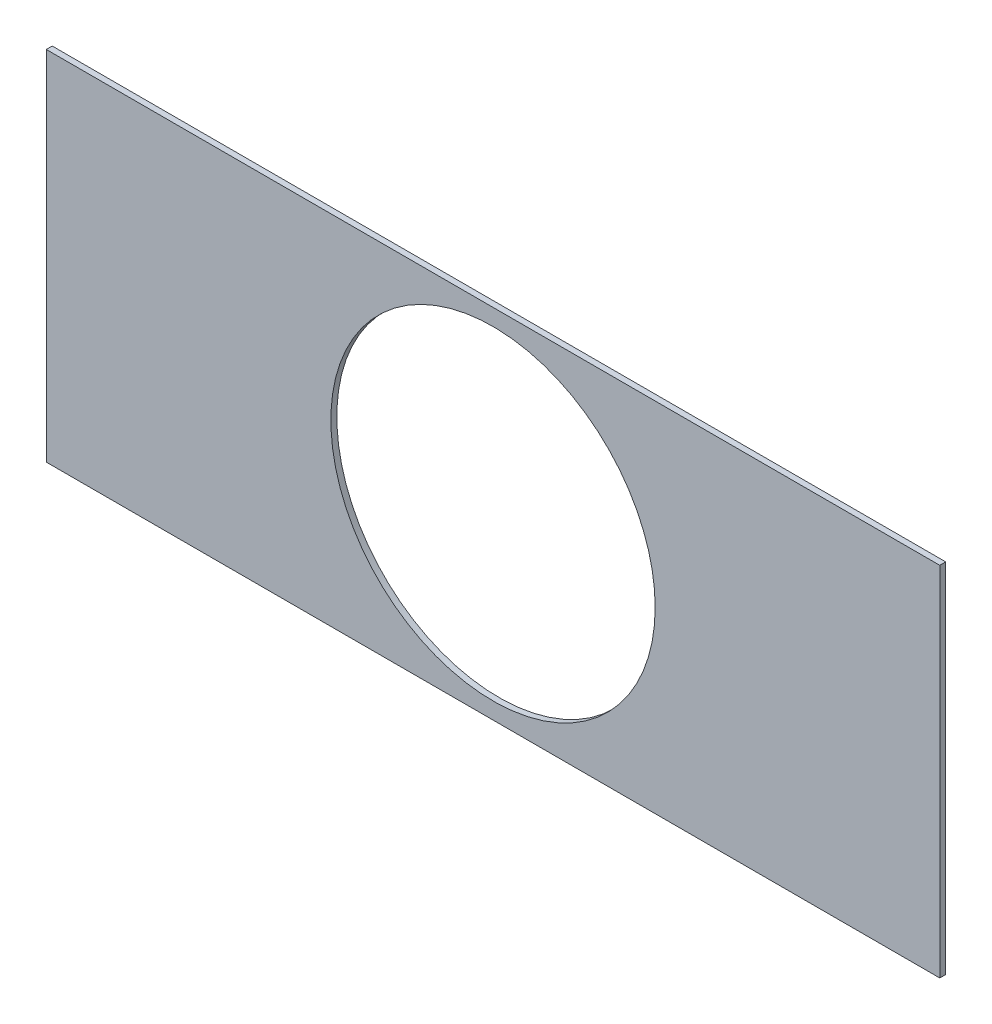
ISO-10303-21;
HEADER;
FILE_DESCRIPTION(('STEP AP214'),'2;1');
FILE_NAME('part.step','',(''),(''),'','','');
FILE_SCHEMA(('AUTOMOTIVE_DESIGN { 1 0 10303 214 1 1 1 1 }'));
ENDSEC;
DATA;
#1=APPLICATION_CONTEXT('core data for automotive mechanical design processes');
#2=APPLICATION_PROTOCOL_DEFINITION('international standard','automotive_design',2000,#1);
#3=PRODUCT_CONTEXT('',#1,'mechanical');
#4=PRODUCT('Part','Part','',(#3));
#5=PRODUCT_RELATED_PRODUCT_CATEGORY('part','',(#4));
#6=PRODUCT_DEFINITION_FORMATION('','',#4);
#7=PRODUCT_DEFINITION_CONTEXT('part definition',#1,'design');
#8=PRODUCT_DEFINITION('design','',#6,#7);
#9=PRODUCT_DEFINITION_SHAPE('','',#8);
#10=(LENGTH_UNIT() NAMED_UNIT(*) SI_UNIT(.MILLI.,.METRE.));
#11=(NAMED_UNIT(*) PLANE_ANGLE_UNIT() SI_UNIT($,.RADIAN.));
#12=(NAMED_UNIT(*) SI_UNIT($,.STERADIAN.) SOLID_ANGLE_UNIT());
#13=UNCERTAINTY_MEASURE_WITH_UNIT(LENGTH_MEASURE(1.E-05),#10,'distance_accuracy_value','');
#14=(GEOMETRIC_REPRESENTATION_CONTEXT(3) GLOBAL_UNCERTAINTY_ASSIGNED_CONTEXT((#13)) GLOBAL_UNIT_ASSIGNED_CONTEXT((#10,
#11,#12)) REPRESENTATION_CONTEXT('',''));
#15=CARTESIAN_POINT('',(0.,0.,0.));
#16=DIRECTION('',(0.,0.,1.));
#17=DIRECTION('',(1.,0.,0.));
#18=AXIS2_PLACEMENT_3D('',#15,#16,#17);
#19=CARTESIAN_POINT('',(0.,0.,2.));
#20=DIRECTION('',(0.,0.,1.));
#21=DIRECTION('',(1.,0.,0.));
#22=AXIS2_PLACEMENT_3D('',#19,#20,#21);
#23=PLANE('',#22);
#24=DIRECTION('',(0.,-1.,0.));
#25=VECTOR('',#24,1.);
#26=CARTESIAN_POINT('',(-150.,-36.7008196721311,2.));
#27=LINE('',#26,#25);
#28=CARTESIAN_POINT('',(-150.,83.2991803278689,2.));
#29=VERTEX_POINT('',#28);
#30=CARTESIAN_POINT('',(-150.,-36.7008196721311,2.));
#31=VERTEX_POINT('',#30);
#32=EDGE_CURVE('E84',#29,#31,#27,.T.);
#33=ORIENTED_EDGE('',*,*,#32,.T.);
#34=DIRECTION('',(1.,0.,0.));
#35=VECTOR('',#34,1.);
#36=CARTESIAN_POINT('',(150.,-36.7008196721311,2.));
#37=LINE('',#36,#35);
#38=CARTESIAN_POINT('',(150.,-36.7008196721311,2.));
#39=VERTEX_POINT('',#38);
#40=EDGE_CURVE('E79',#31,#39,#37,.T.);
#41=ORIENTED_EDGE('',*,*,#40,.T.);
#42=DIRECTION('',(0.,1.,0.));
#43=VECTOR('',#42,1.);
#44=CARTESIAN_POINT('',(150.,-36.7008196721311,2.));
#45=LINE('',#44,#43);
#46=CARTESIAN_POINT('',(150.,83.2991803278689,2.));
#47=VERTEX_POINT('',#46);
#48=EDGE_CURVE('E82',#39,#47,#45,.T.);
#49=ORIENTED_EDGE('',*,*,#48,.T.);
#50=DIRECTION('',(-1.,0.,0.));
#51=VECTOR('',#50,1.);
#52=CARTESIAN_POINT('',(150.,83.2991803278689,2.));
#53=LINE('',#52,#51);
#54=EDGE_CURVE('E49',#47,#29,#53,.T.);
#55=ORIENTED_EDGE('',*,*,#54,.T.);
#56=EDGE_LOOP('',(#33,#41,#49,#55));
#57=FACE_BOUND('',#56,.T.);
#58=CARTESIAN_POINT('',(0.,23.2991803278689,2.));
#59=DIRECTION('',(0.,0.,1.));
#60=DIRECTION('',(1.,0.,0.));
#61=AXIS2_PLACEMENT_3D('',#58,#59,#60);
#62=CIRCLE('',#61,54.4500699844383);
#63=CARTESIAN_POINT('',(54.4500699844384,23.2991803278689,2.));
#64=VERTEX_POINT('',#63);
#65=EDGE_CURVE('E99',#64,#64,#62,.T.);
#66=ORIENTED_EDGE('',*,*,#65,.F.);
#67=EDGE_LOOP('',(#66));
#68=FACE_BOUND('',#67,.T.);
#69=ADVANCED_FACE('F32',(#57,#68),#23,.T.);
#70=CARTESIAN_POINT('',(0.,0.,0.));
#71=DIRECTION('',(0.,0.,1.));
#72=DIRECTION('',(1.,0.,0.));
#73=AXIS2_PLACEMENT_3D('',#70,#71,#72);
#74=PLANE('',#73);
#75=DIRECTION('',(0.,-1.,0.));
#76=VECTOR('',#75,1.);
#77=CARTESIAN_POINT('',(-150.,-36.7008196721311,0.));
#78=LINE('',#77,#76);
#79=CARTESIAN_POINT('',(-150.,83.2991803278689,0.));
#80=VERTEX_POINT('',#79);
#81=CARTESIAN_POINT('',(-150.,-36.7008196721311,0.));
#82=VERTEX_POINT('',#81);
#83=EDGE_CURVE('E96',#80,#82,#78,.T.);
#84=ORIENTED_EDGE('',*,*,#83,.F.);
#85=DIRECTION('',(-1.,0.,0.));
#86=VECTOR('',#85,1.);
#87=CARTESIAN_POINT('',(150.,83.2991803278689,0.));
#88=LINE('',#87,#86);
#89=CARTESIAN_POINT('',(150.,83.2991803278689,0.));
#90=VERTEX_POINT('',#89);
#91=EDGE_CURVE('E72',#90,#80,#88,.T.);
#92=ORIENTED_EDGE('',*,*,#91,.F.);
#93=DIRECTION('',(0.,1.,0.));
#94=VECTOR('',#93,1.);
#95=CARTESIAN_POINT('',(150.,-36.7008196721311,0.));
#96=LINE('',#95,#94);
#97=CARTESIAN_POINT('',(150.,-36.7008196721311,0.));
#98=VERTEX_POINT('',#97);
#99=EDGE_CURVE('E66',#98,#90,#96,.T.);
#100=ORIENTED_EDGE('',*,*,#99,.F.);
#101=DIRECTION('',(1.,0.,0.));
#102=VECTOR('',#101,1.);
#103=CARTESIAN_POINT('',(150.,-36.7008196721311,0.));
#104=LINE('',#103,#102);
#105=EDGE_CURVE('E88',#82,#98,#104,.T.);
#106=ORIENTED_EDGE('',*,*,#105,.F.);
#107=EDGE_LOOP('',(#84,#92,#100,#106));
#108=FACE_BOUND('',#107,.T.);
#109=CARTESIAN_POINT('',(0.,23.2991803278689,0.));
#110=DIRECTION('',(0.,0.,1.));
#111=DIRECTION('',(1.,0.,0.));
#112=AXIS2_PLACEMENT_3D('',#109,#110,#111);
#113=CIRCLE('',#112,54.4500699844383);
#114=CARTESIAN_POINT('',(54.4500699844384,23.2991803278689,0.));
#115=VERTEX_POINT('',#114);
#116=EDGE_CURVE('E111',#115,#115,#113,.T.);
#117=ORIENTED_EDGE('',*,*,#116,.T.);
#118=EDGE_LOOP('',(#117));
#119=FACE_BOUND('',#118,.T.);
#120=ADVANCED_FACE('F107',(#108,#119),#74,.F.);
#121=CARTESIAN_POINT('',(-150.,-36.7008196721311,2.));
#122=DIRECTION('',(1.,0.,0.));
#123=DIRECTION('',(0.,0.,-1.));
#124=AXIS2_PLACEMENT_3D('',#121,#122,#123);
#125=PLANE('',#124);
#126=ORIENTED_EDGE('',*,*,#83,.T.);
#127=DIRECTION('',(0.,0.,-1.));
#128=VECTOR('',#127,1.);
#129=CARTESIAN_POINT('',(-150.,-36.7008196721311,2.));
#130=LINE('',#129,#128);
#131=EDGE_CURVE('E11',#31,#82,#130,.T.);
#132=ORIENTED_EDGE('',*,*,#131,.F.);
#133=ORIENTED_EDGE('',*,*,#32,.F.);
#134=DIRECTION('',(0.,0.,-1.));
#135=VECTOR('',#134,1.);
#136=CARTESIAN_POINT('',(-150.,83.2991803278689,2.));
#137=LINE('',#136,#135);
#138=EDGE_CURVE('E92',#29,#80,#137,.T.);
#139=ORIENTED_EDGE('',*,*,#138,.T.);
#140=EDGE_LOOP('',(#126,#132,#133,#139));
#141=FACE_BOUND('',#140,.T.);
#142=ADVANCED_FACE('F34',(#141),#125,.F.);
#143=CARTESIAN_POINT('',(150.,-36.7008196721311,2.));
#144=DIRECTION('',(0.,1.,0.));
#145=DIRECTION('',(-1.,0.,0.));
#146=AXIS2_PLACEMENT_3D('',#143,#144,#145);
#147=PLANE('',#146);
#148=ORIENTED_EDGE('',*,*,#105,.T.);
#149=DIRECTION('',(0.,0.,-1.));
#150=VECTOR('',#149,1.);
#151=CARTESIAN_POINT('',(150.,-36.7008196721311,2.));
#152=LINE('',#151,#150);
#153=EDGE_CURVE('E41',#39,#98,#152,.T.);
#154=ORIENTED_EDGE('',*,*,#153,.F.);
#155=ORIENTED_EDGE('',*,*,#40,.F.);
#156=ORIENTED_EDGE('',*,*,#131,.T.);
#157=EDGE_LOOP('',(#148,#154,#155,#156));
#158=FACE_BOUND('',#157,.T.);
#159=ADVANCED_FACE('F87',(#158),#147,.F.);
#160=CARTESIAN_POINT('',(150.,-36.7008196721311,2.));
#161=DIRECTION('',(-1.,0.,0.));
#162=DIRECTION('',(0.,0.,1.));
#163=AXIS2_PLACEMENT_3D('',#160,#161,#162);
#164=PLANE('',#163);
#165=ORIENTED_EDGE('',*,*,#99,.T.);
#166=DIRECTION('',(0.,0.,-1.));
#167=VECTOR('',#166,1.);
#168=CARTESIAN_POINT('',(150.,83.2991803278689,2.));
#169=LINE('',#168,#167);
#170=EDGE_CURVE('E89',#47,#90,#169,.T.);
#171=ORIENTED_EDGE('',*,*,#170,.F.);
#172=ORIENTED_EDGE('',*,*,#48,.F.);
#173=ORIENTED_EDGE('',*,*,#153,.T.);
#174=EDGE_LOOP('',(#165,#171,#172,#173));
#175=FACE_BOUND('',#174,.T.);
#176=ADVANCED_FACE('F90',(#175),#164,.F.);
#177=CARTESIAN_POINT('',(150.,83.2991803278689,2.));
#178=DIRECTION('',(0.,-1.,0.));
#179=DIRECTION('',(0.,0.,-1.));
#180=AXIS2_PLACEMENT_3D('',#177,#178,#179);
#181=PLANE('',#180);
#182=ORIENTED_EDGE('',*,*,#91,.T.);
#183=ORIENTED_EDGE('',*,*,#138,.F.);
#184=ORIENTED_EDGE('',*,*,#54,.F.);
#185=ORIENTED_EDGE('',*,*,#170,.T.);
#186=EDGE_LOOP('',(#182,#183,#184,#185));
#187=FACE_BOUND('',#186,.T.);
#188=ADVANCED_FACE('F104',(#187),#181,.F.);
#189=CARTESIAN_POINT('',(0.,23.2991803278689,2.));
#190=DIRECTION('',(0.,0.,-1.));
#191=DIRECTION('',(-1.,0.,0.));
#192=AXIS2_PLACEMENT_3D('',#189,#190,#191);
#193=CYLINDRICAL_SURFACE('',#192,54.4500699844383);
#194=ORIENTED_EDGE('',*,*,#65,.T.);
#195=EDGE_LOOP('',(#194));
#196=FACE_BOUND('',#195,.T.);
#197=ORIENTED_EDGE('',*,*,#116,.F.);
#198=EDGE_LOOP('',(#197));
#199=FACE_BOUND('',#198,.T.);
#200=ADVANCED_FACE('F117',(#196,#199),#193,.F.);
#201=CLOSED_SHELL('',(#69,#120,#142,#159,#176,#188,#200));
#202=MANIFOLD_SOLID_BREP('B2',#201);
#203=ADVANCED_BREP_SHAPE_REPRESENTATION('',(#18,#202),#14);
#204=SHAPE_DEFINITION_REPRESENTATION(#9,#203);
ENDSEC;
END-ISO-10303-21;
